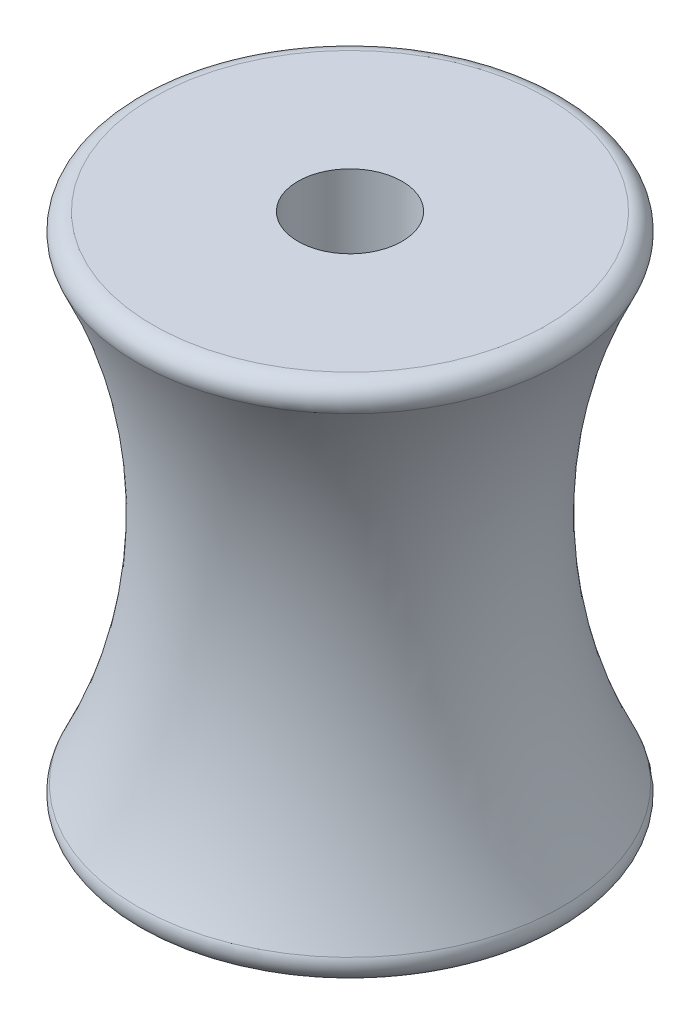
ISO-10303-21;
HEADER;
FILE_DESCRIPTION(('STEP AP214'),'2;1');
FILE_NAME('part.step','',(''),(''),'','','');
FILE_SCHEMA(('AUTOMOTIVE_DESIGN { 1 0 10303 214 1 1 1 1 }'));
ENDSEC;
DATA;
#1=APPLICATION_CONTEXT('core data for automotive mechanical design processes');
#2=APPLICATION_PROTOCOL_DEFINITION('international standard','automotive_design',2000,#1);
#3=PRODUCT_CONTEXT('',#1,'mechanical');
#4=PRODUCT('Part','Part','',(#3));
#5=PRODUCT_RELATED_PRODUCT_CATEGORY('part','',(#4));
#6=PRODUCT_DEFINITION_FORMATION('','',#4);
#7=PRODUCT_DEFINITION_CONTEXT('part definition',#1,'design');
#8=PRODUCT_DEFINITION('design','',#6,#7);
#9=PRODUCT_DEFINITION_SHAPE('','',#8);
#10=(LENGTH_UNIT() NAMED_UNIT(*) SI_UNIT(.MILLI.,.METRE.));
#11=(NAMED_UNIT(*) PLANE_ANGLE_UNIT() SI_UNIT($,.RADIAN.));
#12=(NAMED_UNIT(*) SI_UNIT($,.STERADIAN.) SOLID_ANGLE_UNIT());
#13=UNCERTAINTY_MEASURE_WITH_UNIT(LENGTH_MEASURE(1.E-05),#10,'distance_accuracy_value','');
#14=(GEOMETRIC_REPRESENTATION_CONTEXT(3) GLOBAL_UNCERTAINTY_ASSIGNED_CONTEXT((#13)) GLOBAL_UNIT_ASSIGNED_CONTEXT((#10,
#11,#12)) REPRESENTATION_CONTEXT('',''));
#15=CARTESIAN_POINT('',(0.,0.,0.));
#16=DIRECTION('',(0.,0.,1.));
#17=DIRECTION('',(1.,0.,0.));
#18=AXIS2_PLACEMENT_3D('',#15,#16,#17);
#19=CARTESIAN_POINT('',(-3.,30.,0.));
#20=DIRECTION('',(0.,-1.,0.));
#21=DIRECTION('',(0.,0.,-1.));
#22=AXIS2_PLACEMENT_3D('',#19,#20,#21);
#23=PLANE('',#22);
#24=CARTESIAN_POINT('',(0.,30.,0.));
#25=DIRECTION('',(0.,-1.,0.));
#26=DIRECTION('',(0.,0.,-1.));
#27=AXIS2_PLACEMENT_3D('',#24,#25,#26);
#28=CIRCLE('',#27,11.3508502596338);
#29=CARTESIAN_POINT('',(0.,30.,-11.3508502596338));
#30=VERTEX_POINT('',#29);
#31=EDGE_CURVE('E10',#30,#30,#28,.F.);
#32=ORIENTED_EDGE('',*,*,#31,.T.);
#33=EDGE_LOOP('',(#32));
#34=FACE_BOUND('',#33,.T.);
#35=CARTESIAN_POINT('',(0.,30.,0.));
#36=DIRECTION('',(0.,-1.,0.));
#37=DIRECTION('',(0.,0.,-1.));
#38=AXIS2_PLACEMENT_3D('',#35,#36,#37);
#39=CIRCLE('',#38,3.);
#40=CARTESIAN_POINT('',(0.,30.,-3.));
#41=VERTEX_POINT('',#40);
#42=EDGE_CURVE('E51',#41,#41,#39,.T.);
#43=ORIENTED_EDGE('',*,*,#42,.T.);
#44=EDGE_LOOP('',(#43));
#45=FACE_BOUND('',#44,.T.);
#46=ADVANCED_FACE('F31',(#34,#45),#23,.F.);
#47=CARTESIAN_POINT('',(0.,0.,0.));
#48=DIRECTION('',(0.,-1.,0.));
#49=DIRECTION('',(0.,0.,-1.));
#50=AXIS2_PLACEMENT_3D('',#47,#48,#49);
#51=CYLINDRICAL_SURFACE('',#50,3.);
#52=ORIENTED_EDGE('',*,*,#42,.F.);
#53=EDGE_LOOP('',(#52));
#54=FACE_BOUND('',#53,.T.);
#55=CARTESIAN_POINT('',(0.,0.,0.));
#56=DIRECTION('',(0.,-1.,0.));
#57=DIRECTION('',(0.,0.,-1.));
#58=AXIS2_PLACEMENT_3D('',#55,#56,#57);
#59=CIRCLE('',#58,3.);
#60=CARTESIAN_POINT('',(0.,0.,-3.));
#61=VERTEX_POINT('',#60);
#62=EDGE_CURVE('E54',#61,#61,#59,.T.);
#63=ORIENTED_EDGE('',*,*,#62,.T.);
#64=EDGE_LOOP('',(#63));
#65=FACE_BOUND('',#64,.T.);
#66=ADVANCED_FACE('F58',(#54,#65),#51,.F.);
#67=CARTESIAN_POINT('',(-3.,0.,0.));
#68=DIRECTION('',(0.,1.,0.));
#69=DIRECTION('',(0.,0.,1.));
#70=AXIS2_PLACEMENT_3D('',#67,#68,#69);
#71=PLANE('',#70);
#72=CARTESIAN_POINT('',(0.,0.,0.));
#73=DIRECTION('',(0.,1.,0.));
#74=DIRECTION('',(0.,0.,1.));
#75=AXIS2_PLACEMENT_3D('',#72,#73,#74);
#76=CIRCLE('',#75,11.3508502596338);
#77=CARTESIAN_POINT('',(0.,0.,11.3508502596338));
#78=VERTEX_POINT('',#77);
#79=EDGE_CURVE('E46',#78,#78,#76,.F.);
#80=ORIENTED_EDGE('',*,*,#79,.T.);
#81=EDGE_LOOP('',(#80));
#82=FACE_BOUND('',#81,.T.);
#83=ORIENTED_EDGE('',*,*,#62,.F.);
#84=EDGE_LOOP('',(#83));
#85=FACE_BOUND('',#84,.T.);
#86=ADVANCED_FACE('F60',(#82,#85),#71,.F.);
#87=CARTESIAN_POINT('',(0.,15.,0.));
#88=DIRECTION('',(0.,-1.,0.));
#89=DIRECTION('',(0.,0.,-1.));
#90=AXIS2_PLACEMENT_3D('',#87,#88,#89);
#91=TOROIDAL_SURFACE('',#90,40.,30.886890422961);
#92=CARTESIAN_POINT('',(0.,1.43905190547896,0.));
#93=DIRECTION('',(0.,1.,0.));
#94=DIRECTION('',(0.,0.,1.));
#95=AXIS2_PLACEMENT_3D('',#92,#93,#94);
#96=CIRCLE('',#95,12.249311958481);
#97=CARTESIAN_POINT('',(0.,1.43905190547896,12.249311958481));
#98=VERTEX_POINT('',#97);
#99=EDGE_CURVE('E38',#98,#98,#96,.T.);
#100=ORIENTED_EDGE('',*,*,#99,.T.);
#101=EDGE_LOOP('',(#100));
#102=FACE_BOUND('',#101,.T.);
#103=CARTESIAN_POINT('',(0.,28.560948094521,0.));
#104=DIRECTION('',(0.,-1.,0.));
#105=DIRECTION('',(0.,0.,-1.));
#106=AXIS2_PLACEMENT_3D('',#103,#104,#105);
#107=CIRCLE('',#106,12.249311958481);
#108=CARTESIAN_POINT('',(0.,28.560948094521,-12.249311958481));
#109=VERTEX_POINT('',#108);
#110=EDGE_CURVE('E42',#109,#109,#107,.T.);
#111=ORIENTED_EDGE('',*,*,#110,.T.);
#112=EDGE_LOOP('',(#111));
#113=FACE_BOUND('',#112,.T.);
#114=ADVANCED_FACE('F62',(#102,#113),#91,.F.);
#115=CARTESIAN_POINT('',(0.,0.999999999999999,0.));
#116=DIRECTION('',(0.,-1.,0.));
#117=DIRECTION('',(0.,0.,-1.));
#118=AXIS2_PLACEMENT_3D('',#115,#116,#117);
#119=TOROIDAL_SURFACE('',#118,11.3508502596338,1.);
#120=ORIENTED_EDGE('',*,*,#99,.F.);
#121=EDGE_LOOP('',(#120));
#122=FACE_BOUND('',#121,.T.);
#123=ORIENTED_EDGE('',*,*,#79,.F.);
#124=EDGE_LOOP('',(#123));
#125=FACE_BOUND('',#124,.T.);
#126=ADVANCED_FACE('F69',(#122,#125),#119,.T.);
#127=CARTESIAN_POINT('',(0.,29.,0.));
#128=DIRECTION('',(0.,1.,0.));
#129=DIRECTION('',(0.,0.,1.));
#130=AXIS2_PLACEMENT_3D('',#127,#128,#129);
#131=TOROIDAL_SURFACE('',#130,11.3508502596338,1.);
#132=ORIENTED_EDGE('',*,*,#31,.F.);
#133=EDGE_LOOP('',(#132));
#134=FACE_BOUND('',#133,.T.);
#135=ORIENTED_EDGE('',*,*,#110,.F.);
#136=EDGE_LOOP('',(#135));
#137=FACE_BOUND('',#136,.T.);
#138=ADVANCED_FACE('F33',(#134,#137),#131,.T.);
#139=CLOSED_SHELL('',(#46,#66,#86,#114,#126,#138));
#140=MANIFOLD_SOLID_BREP('B2',#139);
#141=ADVANCED_BREP_SHAPE_REPRESENTATION('',(#18,#140),#14);
#142=SHAPE_DEFINITION_REPRESENTATION(#9,#141);
ENDSEC;
END-ISO-10303-21;
